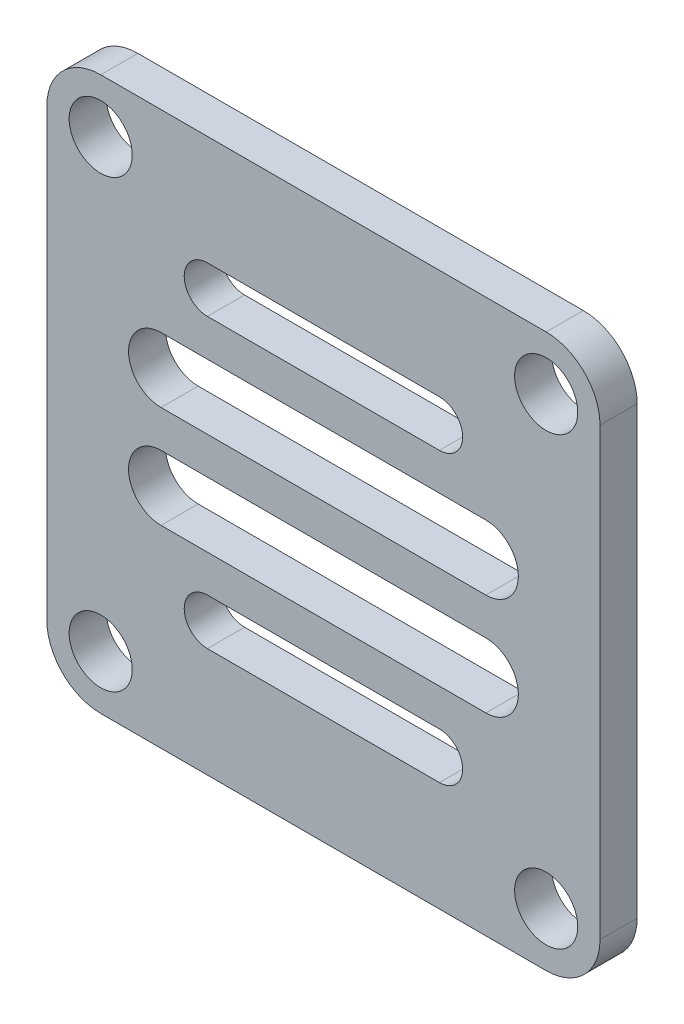
ISO-10303-21;
HEADER;
FILE_DESCRIPTION(('STEP AP214'),'2;1');
FILE_NAME('part.step','',(''),(''),'','','');
FILE_SCHEMA(('AUTOMOTIVE_DESIGN { 1 0 10303 214 1 1 1 1 }'));
ENDSEC;
DATA;
#1=APPLICATION_CONTEXT('core data for automotive mechanical design processes');
#2=APPLICATION_PROTOCOL_DEFINITION('international standard','automotive_design',2000,#1);
#3=PRODUCT_CONTEXT('',#1,'mechanical');
#4=PRODUCT('Part','Part','',(#3));
#5=PRODUCT_RELATED_PRODUCT_CATEGORY('part','',(#4));
#6=PRODUCT_DEFINITION_FORMATION('','',#4);
#7=PRODUCT_DEFINITION_CONTEXT('part definition',#1,'design');
#8=PRODUCT_DEFINITION('design','',#6,#7);
#9=PRODUCT_DEFINITION_SHAPE('','',#8);
#10=(LENGTH_UNIT() NAMED_UNIT(*) SI_UNIT(.MILLI.,.METRE.));
#11=(NAMED_UNIT(*) PLANE_ANGLE_UNIT() SI_UNIT($,.RADIAN.));
#12=(NAMED_UNIT(*) SI_UNIT($,.STERADIAN.) SOLID_ANGLE_UNIT());
#13=UNCERTAINTY_MEASURE_WITH_UNIT(LENGTH_MEASURE(1.E-05),#10,'distance_accuracy_value','');
#14=(GEOMETRIC_REPRESENTATION_CONTEXT(3) GLOBAL_UNCERTAINTY_ASSIGNED_CONTEXT((#13)) GLOBAL_UNIT_ASSIGNED_CONTEXT((#10,
#11,#12)) REPRESENTATION_CONTEXT('',''));
#15=CARTESIAN_POINT('',(0.,0.,0.));
#16=DIRECTION('',(0.,0.,1.));
#17=DIRECTION('',(1.,0.,0.));
#18=AXIS2_PLACEMENT_3D('',#15,#16,#17);
#19=CARTESIAN_POINT('',(-32.3999999999982,0.,-2.));
#20=DIRECTION('',(1.,0.,0.));
#21=DIRECTION('',(0.,0.,-1.));
#22=AXIS2_PLACEMENT_3D('',#19,#20,#21);
#23=PLANE('',#22);
#24=DIRECTION('',(0.,1.,0.));
#25=VECTOR('',#24,1.);
#26=CARTESIAN_POINT('',(-32.3999999999982,0.,0.));
#27=LINE('',#26,#25);
#28=CARTESIAN_POINT('',(-32.3999999999982,-10.5,0.));
#29=VERTEX_POINT('',#28);
#30=CARTESIAN_POINT('',(-32.3999999999982,13.5,0.));
#31=VERTEX_POINT('',#30);
#32=EDGE_CURVE('E246',#29,#31,#27,.T.);
#33=ORIENTED_EDGE('',*,*,#32,.T.);
#34=DIRECTION('',(0.,0.,1.));
#35=VECTOR('',#34,1.);
#36=CARTESIAN_POINT('',(-32.3999999999982,13.5,-2.));
#37=LINE('',#36,#35);
#38=CARTESIAN_POINT('',(-32.3999999999982,13.5,-2.));
#39=VERTEX_POINT('',#38);
#40=EDGE_CURVE('E281',#39,#31,#37,.T.);
#41=ORIENTED_EDGE('',*,*,#40,.F.);
#42=DIRECTION('',(0.,1.,0.));
#43=VECTOR('',#42,1.);
#44=CARTESIAN_POINT('',(-32.3999999999982,0.,-2.));
#45=LINE('',#44,#43);
#46=CARTESIAN_POINT('',(-32.3999999999982,-10.5,-2.));
#47=VERTEX_POINT('',#46);
#48=EDGE_CURVE('E209',#47,#39,#45,.T.);
#49=ORIENTED_EDGE('',*,*,#48,.F.);
#50=DIRECTION('',(0.,0.,1.));
#51=VECTOR('',#50,1.);
#52=CARTESIAN_POINT('',(-32.3999999999982,-10.5,-2.));
#53=LINE('',#52,#51);
#54=EDGE_CURVE('E114',#47,#29,#53,.T.);
#55=ORIENTED_EDGE('',*,*,#54,.T.);
#56=EDGE_LOOP('',(#33,#41,#49,#55));
#57=FACE_BOUND('',#56,.T.);
#58=ADVANCED_FACE('F33',(#57),#23,.F.);
#59=CARTESIAN_POINT('',(-29.4999999999982,13.5,-2.));
#60=DIRECTION('',(0.,0.,1.));
#61=DIRECTION('',(1.,0.,0.));
#62=AXIS2_PLACEMENT_3D('',#59,#60,#61);
#63=CYLINDRICAL_SURFACE('',#62,2.9);
#64=CARTESIAN_POINT('',(-29.4999999999982,13.5,0.));
#65=DIRECTION('',(0.,0.,1.));
#66=DIRECTION('',(1.,0.,0.));
#67=AXIS2_PLACEMENT_3D('',#64,#65,#66);
#68=CIRCLE('',#67,2.9);
#69=CARTESIAN_POINT('',(-29.4999999999982,16.4,0.));
#70=VERTEX_POINT('',#69);
#71=EDGE_CURVE('E267',#70,#31,#68,.T.);
#72=ORIENTED_EDGE('',*,*,#71,.F.);
#73=DIRECTION('',(0.,0.,1.));
#74=VECTOR('',#73,1.);
#75=CARTESIAN_POINT('',(-29.4999999999982,16.4,-2.));
#76=LINE('',#75,#74);
#77=CARTESIAN_POINT('',(-29.4999999999982,16.4,-2.));
#78=VERTEX_POINT('',#77);
#79=EDGE_CURVE('E284',#78,#70,#76,.T.);
#80=ORIENTED_EDGE('',*,*,#79,.F.);
#81=CARTESIAN_POINT('',(-29.4999999999982,13.5,-2.));
#82=DIRECTION('',(0.,0.,1.));
#83=DIRECTION('',(1.,0.,0.));
#84=AXIS2_PLACEMENT_3D('',#81,#82,#83);
#85=CIRCLE('',#84,2.9);
#86=EDGE_CURVE('E231',#78,#39,#85,.T.);
#87=ORIENTED_EDGE('',*,*,#86,.T.);
#88=ORIENTED_EDGE('',*,*,#40,.T.);
#89=EDGE_LOOP('',(#72,#80,#87,#88));
#90=FACE_BOUND('',#89,.T.);
#91=ADVANCED_FACE('F446',(#90),#63,.T.);
#92=CARTESIAN_POINT('',(0.,16.4,-2.));
#93=DIRECTION('',(0.,1.,0.));
#94=DIRECTION('',(0.,0.,1.));
#95=AXIS2_PLACEMENT_3D('',#92,#93,#94);
#96=PLANE('',#95);
#97=DIRECTION('',(-1.,0.,0.));
#98=VECTOR('',#97,1.);
#99=CARTESIAN_POINT('',(0.,16.4,0.));
#100=LINE('',#99,#98);
#101=CARTESIAN_POINT('',(-5.49999999999824,16.4,0.));
#102=VERTEX_POINT('',#101);
#103=EDGE_CURVE('E264',#102,#70,#100,.T.);
#104=ORIENTED_EDGE('',*,*,#103,.F.);
#105=DIRECTION('',(0.,0.,1.));
#106=VECTOR('',#105,1.);
#107=CARTESIAN_POINT('',(-5.49999999999824,16.4,-2.));
#108=LINE('',#107,#106);
#109=CARTESIAN_POINT('',(-5.49999999999824,16.4,-2.));
#110=VERTEX_POINT('',#109);
#111=EDGE_CURVE('E286',#110,#102,#108,.T.);
#112=ORIENTED_EDGE('',*,*,#111,.F.);
#113=DIRECTION('',(-1.,0.,0.));
#114=VECTOR('',#113,1.);
#115=CARTESIAN_POINT('',(0.,16.4,-2.));
#116=LINE('',#115,#114);
#117=EDGE_CURVE('E228',#110,#78,#116,.T.);
#118=ORIENTED_EDGE('',*,*,#117,.T.);
#119=ORIENTED_EDGE('',*,*,#79,.T.);
#120=EDGE_LOOP('',(#104,#112,#118,#119));
#121=FACE_BOUND('',#120,.T.);
#122=ADVANCED_FACE('F448',(#121),#96,.T.);
#123=CARTESIAN_POINT('',(-5.49999999999824,13.5,-2.));
#124=DIRECTION('',(0.,0.,1.));
#125=DIRECTION('',(1.,0.,0.));
#126=AXIS2_PLACEMENT_3D('',#123,#124,#125);
#127=CYLINDRICAL_SURFACE('',#126,2.9);
#128=CARTESIAN_POINT('',(-5.49999999999824,13.5,0.));
#129=DIRECTION('',(0.,0.,1.));
#130=DIRECTION('',(1.,0.,0.));
#131=AXIS2_PLACEMENT_3D('',#128,#129,#130);
#132=CIRCLE('',#131,2.9);
#133=CARTESIAN_POINT('',(-2.59999999999824,13.5,6.17561557447743E-13));
#134=VERTEX_POINT('',#133);
#135=EDGE_CURVE('E261',#134,#102,#132,.T.);
#136=ORIENTED_EDGE('',*,*,#135,.F.);
#137=DIRECTION('',(0.,0.,1.));
#138=VECTOR('',#137,1.);
#139=CARTESIAN_POINT('',(-2.59999999999824,13.5,-1.99999999999938));
#140=LINE('',#139,#138);
#141=CARTESIAN_POINT('',(-2.59999999999824,13.5,-1.99999999999938));
#142=VERTEX_POINT('',#141);
#143=EDGE_CURVE('E288',#142,#134,#140,.T.);
#144=ORIENTED_EDGE('',*,*,#143,.F.);
#145=CARTESIAN_POINT('',(-5.49999999999824,13.5,-2.));
#146=DIRECTION('',(0.,0.,1.));
#147=DIRECTION('',(1.,0.,0.));
#148=AXIS2_PLACEMENT_3D('',#145,#146,#147);
#149=CIRCLE('',#148,2.9);
#150=EDGE_CURVE('E225',#142,#110,#149,.T.);
#151=ORIENTED_EDGE('',*,*,#150,.T.);
#152=ORIENTED_EDGE('',*,*,#111,.T.);
#153=EDGE_LOOP('',(#136,#144,#151,#152));
#154=FACE_BOUND('',#153,.T.);
#155=ADVANCED_FACE('F454',(#154),#127,.T.);
#156=CARTESIAN_POINT('',(-2.59999999999824,0.,-1.99999999999876));
#157=DIRECTION('',(1.,0.,0.));
#158=DIRECTION('',(0.,1.,0.));
#159=AXIS2_PLACEMENT_3D('',#156,#157,#158);
#160=PLANE('',#159);
#161=DIRECTION('',(0.,1.,0.));
#162=VECTOR('',#161,1.);
#163=CARTESIAN_POINT('',(-2.59999999999824,0.,1.23512311489549E-12));
#164=LINE('',#163,#162);
#165=CARTESIAN_POINT('',(-2.59999999999824,-10.5,6.17561557447743E-13));
#166=VERTEX_POINT('',#165);
#167=EDGE_CURVE('E258',#166,#134,#164,.T.);
#168=ORIENTED_EDGE('',*,*,#167,.F.);
#169=DIRECTION('',(0.,0.,1.));
#170=VECTOR('',#169,1.);
#171=CARTESIAN_POINT('',(-2.59999999999824,-10.5,-1.99999999999938));
#172=LINE('',#171,#170);
#173=CARTESIAN_POINT('',(-2.59999999999824,-10.5,-1.99999999999938));
#174=VERTEX_POINT('',#173);
#175=EDGE_CURVE('E290',#174,#166,#172,.T.);
#176=ORIENTED_EDGE('',*,*,#175,.F.);
#177=DIRECTION('',(0.,1.,0.));
#178=VECTOR('',#177,1.);
#179=CARTESIAN_POINT('',(-2.59999999999824,0.,-1.99999999999876));
#180=LINE('',#179,#178);
#181=EDGE_CURVE('E222',#174,#142,#180,.T.);
#182=ORIENTED_EDGE('',*,*,#181,.T.);
#183=ORIENTED_EDGE('',*,*,#143,.T.);
#184=EDGE_LOOP('',(#168,#176,#182,#183));
#185=FACE_BOUND('',#184,.T.);
#186=ADVANCED_FACE('F463',(#185),#160,.T.);
#187=CARTESIAN_POINT('',(-5.49999999999824,-10.5,-2.));
#188=DIRECTION('',(0.,0.,1.));
#189=DIRECTION('',(1.,0.,0.));
#190=AXIS2_PLACEMENT_3D('',#187,#188,#189);
#191=CYLINDRICAL_SURFACE('',#190,2.9);
#192=CARTESIAN_POINT('',(-5.49999999999824,-10.5,0.));
#193=DIRECTION('',(0.,0.,1.));
#194=DIRECTION('',(1.,0.,0.));
#195=AXIS2_PLACEMENT_3D('',#192,#193,#194);
#196=CIRCLE('',#195,2.9);
#197=CARTESIAN_POINT('',(-5.49999999999824,-13.4,0.));
#198=VERTEX_POINT('',#197);
#199=EDGE_CURVE('E255',#198,#166,#196,.T.);
#200=ORIENTED_EDGE('',*,*,#199,.F.);
#201=DIRECTION('',(0.,0.,1.));
#202=VECTOR('',#201,1.);
#203=CARTESIAN_POINT('',(-5.49999999999824,-13.4,-2.));
#204=LINE('',#203,#202);
#205=CARTESIAN_POINT('',(-5.49999999999824,-13.4,-2.));
#206=VERTEX_POINT('',#205);
#207=EDGE_CURVE('E292',#206,#198,#204,.T.);
#208=ORIENTED_EDGE('',*,*,#207,.F.);
#209=CARTESIAN_POINT('',(-5.49999999999824,-10.5,-2.));
#210=DIRECTION('',(0.,0.,1.));
#211=DIRECTION('',(1.,0.,0.));
#212=AXIS2_PLACEMENT_3D('',#209,#210,#211);
#213=CIRCLE('',#212,2.9);
#214=EDGE_CURVE('E219',#206,#174,#213,.T.);
#215=ORIENTED_EDGE('',*,*,#214,.T.);
#216=ORIENTED_EDGE('',*,*,#175,.T.);
#217=EDGE_LOOP('',(#200,#208,#215,#216));
#218=FACE_BOUND('',#217,.T.);
#219=ADVANCED_FACE('F467',(#218),#191,.T.);
#220=CARTESIAN_POINT('',(0.,-13.4,-2.));
#221=DIRECTION('',(0.,1.,0.));
#222=DIRECTION('',(-1.,0.,0.));
#223=AXIS2_PLACEMENT_3D('',#220,#221,#222);
#224=PLANE('',#223);
#225=DIRECTION('',(-1.,0.,0.));
#226=VECTOR('',#225,1.);
#227=CARTESIAN_POINT('',(0.,-13.4,0.));
#228=LINE('',#227,#226);
#229=CARTESIAN_POINT('',(-29.4999999999982,-13.4,0.));
#230=VERTEX_POINT('',#229);
#231=EDGE_CURVE('E252',#198,#230,#228,.T.);
#232=ORIENTED_EDGE('',*,*,#231,.T.);
#233=DIRECTION('',(0.,0.,1.));
#234=VECTOR('',#233,1.);
#235=CARTESIAN_POINT('',(-29.4999999999982,-13.4,-2.));
#236=LINE('',#235,#234);
#237=CARTESIAN_POINT('',(-29.4999999999982,-13.4,-2.));
#238=VERTEX_POINT('',#237);
#239=EDGE_CURVE('E294',#238,#230,#236,.T.);
#240=ORIENTED_EDGE('',*,*,#239,.F.);
#241=DIRECTION('',(-1.,0.,0.));
#242=VECTOR('',#241,1.);
#243=CARTESIAN_POINT('',(0.,-13.4,-2.));
#244=LINE('',#243,#242);
#245=EDGE_CURVE('E216',#206,#238,#244,.T.);
#246=ORIENTED_EDGE('',*,*,#245,.F.);
#247=ORIENTED_EDGE('',*,*,#207,.T.);
#248=EDGE_LOOP('',(#232,#240,#246,#247));
#249=FACE_BOUND('',#248,.T.);
#250=ADVANCED_FACE('F471',(#249),#224,.F.);
#251=CARTESIAN_POINT('',(-5.49999999999824,-10.5,-2.));
#252=DIRECTION('',(0.,0.,1.));
#253=DIRECTION('',(1.,0.,0.));
#254=AXIS2_PLACEMENT_3D('',#251,#252,#253);
#255=CYLINDRICAL_SURFACE('',#254,1.7);
#256=CARTESIAN_POINT('',(-5.49999999999824,-10.5,-2.));
#257=DIRECTION('',(0.,0.,1.));
#258=DIRECTION('',(1.,0.,0.));
#259=AXIS2_PLACEMENT_3D('',#256,#257,#258);
#260=CIRCLE('',#259,1.7);
#261=CARTESIAN_POINT('',(-3.79999999999824,-10.5,-2.));
#262=VERTEX_POINT('',#261);
#263=EDGE_CURVE('E240',#262,#262,#260,.T.);
#264=ORIENTED_EDGE('',*,*,#263,.F.);
#265=EDGE_LOOP('',(#264));
#266=FACE_BOUND('',#265,.T.);
#267=CARTESIAN_POINT('',(-5.49999999999824,-10.5,0.));
#268=DIRECTION('',(0.,0.,1.));
#269=DIRECTION('',(1.,0.,0.));
#270=AXIS2_PLACEMENT_3D('',#267,#268,#269);
#271=CIRCLE('',#270,1.7);
#272=CARTESIAN_POINT('',(-3.79999999999824,-10.5,0.));
#273=VERTEX_POINT('',#272);
#274=EDGE_CURVE('E276',#273,#273,#271,.T.);
#275=ORIENTED_EDGE('',*,*,#274,.T.);
#276=EDGE_LOOP('',(#275));
#277=FACE_BOUND('',#276,.T.);
#278=ADVANCED_FACE('F474',(#266,#277),#255,.F.);
#279=CARTESIAN_POINT('',(-5.49999999999824,13.5,-2.));
#280=DIRECTION('',(0.,0.,1.));
#281=DIRECTION('',(1.,0.,0.));
#282=AXIS2_PLACEMENT_3D('',#279,#280,#281);
#283=CYLINDRICAL_SURFACE('',#282,1.7);
#284=CARTESIAN_POINT('',(-5.49999999999824,13.5,-2.));
#285=DIRECTION('',(0.,0.,1.));
#286=DIRECTION('',(1.,0.,0.));
#287=AXIS2_PLACEMENT_3D('',#284,#285,#286);
#288=CIRCLE('',#287,1.7);
#289=CARTESIAN_POINT('',(-3.79999999999824,13.5,-2.));
#290=VERTEX_POINT('',#289);
#291=EDGE_CURVE('E237',#290,#290,#288,.T.);
#292=ORIENTED_EDGE('',*,*,#291,.F.);
#293=EDGE_LOOP('',(#292));
#294=FACE_BOUND('',#293,.T.);
#295=CARTESIAN_POINT('',(-5.49999999999824,13.5,0.));
#296=DIRECTION('',(0.,0.,1.));
#297=DIRECTION('',(1.,0.,0.));
#298=AXIS2_PLACEMENT_3D('',#295,#296,#297);
#299=CIRCLE('',#298,1.7);
#300=CARTESIAN_POINT('',(-3.79999999999824,13.5,0.));
#301=VERTEX_POINT('',#300);
#302=EDGE_CURVE('E273',#301,#301,#299,.T.);
#303=ORIENTED_EDGE('',*,*,#302,.T.);
#304=EDGE_LOOP('',(#303));
#305=FACE_BOUND('',#304,.T.);
#306=ADVANCED_FACE('F486',(#294,#305),#283,.F.);
#307=CARTESIAN_POINT('',(-29.4999999999982,13.5,-2.));
#308=DIRECTION('',(0.,0.,1.));
#309=DIRECTION('',(1.,0.,0.));
#310=AXIS2_PLACEMENT_3D('',#307,#308,#309);
#311=CYLINDRICAL_SURFACE('',#310,1.7);
#312=CARTESIAN_POINT('',(-29.4999999999982,13.5,-2.));
#313=DIRECTION('',(0.,0.,1.));
#314=DIRECTION('',(1.,0.,0.));
#315=AXIS2_PLACEMENT_3D('',#312,#313,#314);
#316=CIRCLE('',#315,1.7);
#317=CARTESIAN_POINT('',(-27.7999999999982,13.5,-2.));
#318=VERTEX_POINT('',#317);
#319=EDGE_CURVE('E234',#318,#318,#316,.T.);
#320=ORIENTED_EDGE('',*,*,#319,.F.);
#321=EDGE_LOOP('',(#320));
#322=FACE_BOUND('',#321,.T.);
#323=CARTESIAN_POINT('',(-29.4999999999982,13.5,0.));
#324=DIRECTION('',(0.,0.,1.));
#325=DIRECTION('',(1.,0.,0.));
#326=AXIS2_PLACEMENT_3D('',#323,#324,#325);
#327=CIRCLE('',#326,1.7);
#328=CARTESIAN_POINT('',(-27.7999999999982,13.5,0.));
#329=VERTEX_POINT('',#328);
#330=EDGE_CURVE('E270',#329,#329,#327,.T.);
#331=ORIENTED_EDGE('',*,*,#330,.T.);
#332=EDGE_LOOP('',(#331));
#333=FACE_BOUND('',#332,.T.);
#334=ADVANCED_FACE('F458',(#322,#333),#311,.F.);
#335=CARTESIAN_POINT('',(-29.4999999999982,-10.5,-2.));
#336=DIRECTION('',(0.,0.,1.));
#337=DIRECTION('',(1.,0.,0.));
#338=AXIS2_PLACEMENT_3D('',#335,#336,#337);
#339=CYLINDRICAL_SURFACE('',#338,2.9);
#340=CARTESIAN_POINT('',(-29.4999999999982,-10.5,0.));
#341=DIRECTION('',(0.,0.,1.));
#342=DIRECTION('',(1.,0.,0.));
#343=AXIS2_PLACEMENT_3D('',#340,#341,#342);
#344=CIRCLE('',#343,2.9);
#345=EDGE_CURVE('E248',#29,#230,#344,.T.);
#346=ORIENTED_EDGE('',*,*,#345,.F.);
#347=ORIENTED_EDGE('',*,*,#54,.F.);
#348=CARTESIAN_POINT('',(-29.4999999999982,-10.5,-2.));
#349=DIRECTION('',(0.,0.,1.));
#350=DIRECTION('',(1.,0.,0.));
#351=AXIS2_PLACEMENT_3D('',#348,#349,#350);
#352=CIRCLE('',#351,2.9);
#353=EDGE_CURVE('E212',#47,#238,#352,.T.);
#354=ORIENTED_EDGE('',*,*,#353,.T.);
#355=ORIENTED_EDGE('',*,*,#239,.T.);
#356=EDGE_LOOP('',(#346,#347,#354,#355));
#357=FACE_BOUND('',#356,.T.);
#358=ADVANCED_FACE('F476',(#357),#339,.T.);
#359=CARTESIAN_POINT('',(-29.4999999999982,-10.5,-2.));
#360=DIRECTION('',(0.,0.,1.));
#361=DIRECTION('',(1.,0.,0.));
#362=AXIS2_PLACEMENT_3D('',#359,#360,#361);
#363=CYLINDRICAL_SURFACE('',#362,1.7);
#364=CARTESIAN_POINT('',(-29.4999999999982,-10.5,-2.));
#365=DIRECTION('',(0.,0.,1.));
#366=DIRECTION('',(1.,0.,0.));
#367=AXIS2_PLACEMENT_3D('',#364,#365,#366);
#368=CIRCLE('',#367,1.7);
#369=CARTESIAN_POINT('',(-27.7999999999982,-10.5,-2.));
#370=VERTEX_POINT('',#369);
#371=EDGE_CURVE('E243',#370,#370,#368,.T.);
#372=ORIENTED_EDGE('',*,*,#371,.F.);
#373=EDGE_LOOP('',(#372));
#374=FACE_BOUND('',#373,.T.);
#375=CARTESIAN_POINT('',(-29.4999999999982,-10.5,0.));
#376=DIRECTION('',(0.,0.,1.));
#377=DIRECTION('',(1.,0.,0.));
#378=AXIS2_PLACEMENT_3D('',#375,#376,#377);
#379=CIRCLE('',#378,1.7);
#380=CARTESIAN_POINT('',(-27.7999999999982,-10.5,0.));
#381=VERTEX_POINT('',#380);
#382=EDGE_CURVE('E213',#381,#381,#379,.T.);
#383=ORIENTED_EDGE('',*,*,#382,.T.);
#384=EDGE_LOOP('',(#383));
#385=FACE_BOUND('',#384,.T.);
#386=ADVANCED_FACE('F478',(#374,#385),#363,.F.);
#387=CARTESIAN_POINT('',(0.,0.,-2.));
#388=DIRECTION('',(0.,0.,1.));
#389=DIRECTION('',(1.,0.,0.));
#390=AXIS2_PLACEMENT_3D('',#387,#388,#389);
#391=PLANE('',#390);
#392=DIRECTION('',(-1.,0.,0.));
#393=VECTOR('',#392,1.);
#394=CARTESIAN_POINT('',(-23.7499999999982,10.5,-2.));
#395=LINE('',#394,#393);
#396=CARTESIAN_POINT('',(-11.2499999999982,10.5,-2.));
#397=VERTEX_POINT('',#396);
#398=CARTESIAN_POINT('',(-23.7499999999982,10.5,-2.));
#399=VERTEX_POINT('',#398);
#400=EDGE_CURVE('E335',#397,#399,#395,.T.);
#401=ORIENTED_EDGE('',*,*,#400,.T.);
#402=CARTESIAN_POINT('',(-23.7499999999982,9.25000000000003,-2.));
#403=DIRECTION('',(0.,0.,1.));
#404=DIRECTION('',(1.,0.,0.));
#405=AXIS2_PLACEMENT_3D('',#402,#403,#404);
#406=CIRCLE('',#405,1.25);
#407=CARTESIAN_POINT('',(-23.7499999999982,8.00000000000003,-2.));
#408=VERTEX_POINT('',#407);
#409=EDGE_CURVE('E377',#399,#408,#406,.T.);
#410=ORIENTED_EDGE('',*,*,#409,.T.);
#411=DIRECTION('',(1.,0.,0.));
#412=VECTOR('',#411,1.);
#413=CARTESIAN_POINT('',(-23.7499999999982,8.00000000000003,-2.));
#414=LINE('',#413,#412);
#415=CARTESIAN_POINT('',(-11.2499999999982,8.00000000000003,-2.));
#416=VERTEX_POINT('',#415);
#417=EDGE_CURVE('E351',#408,#416,#414,.T.);
#418=ORIENTED_EDGE('',*,*,#417,.T.);
#419=CARTESIAN_POINT('',(-11.2499999999982,9.25000000000003,-2.));
#420=DIRECTION('',(0.,0.,1.));
#421=DIRECTION('',(1.,0.,0.));
#422=AXIS2_PLACEMENT_3D('',#419,#420,#421);
#423=CIRCLE('',#422,1.25);
#424=EDGE_CURVE('E49',#416,#397,#423,.T.);
#425=ORIENTED_EDGE('',*,*,#424,.T.);
#426=EDGE_LOOP('',(#401,#410,#418,#425));
#427=FACE_BOUND('',#426,.T.);
#428=DIRECTION('',(-1.,0.,0.));
#429=VECTOR('',#428,1.);
#430=CARTESIAN_POINT('',(-26.2499999999982,6.00000000000003,-2.));
#431=LINE('',#430,#429);
#432=CARTESIAN_POINT('',(-8.74999999999823,6.00000000000003,-2.));
#433=VERTEX_POINT('',#432);
#434=CARTESIAN_POINT('',(-26.2499999999982,6.00000000000003,-2.));
#435=VERTEX_POINT('',#434);
#436=EDGE_CURVE('E366',#433,#435,#431,.T.);
#437=ORIENTED_EDGE('',*,*,#436,.T.);
#438=CARTESIAN_POINT('',(-26.2499999999982,4.25000000000003,-2.));
#439=DIRECTION('',(0.,0.,1.));
#440=DIRECTION('',(1.,0.,0.));
#441=AXIS2_PLACEMENT_3D('',#438,#439,#440);
#442=CIRCLE('',#441,1.75);
#443=CARTESIAN_POINT('',(-26.2499999999982,2.50000000000003,-2.));
#444=VERTEX_POINT('',#443);
#445=EDGE_CURVE('E185',#435,#444,#442,.T.);
#446=ORIENTED_EDGE('',*,*,#445,.T.);
#447=DIRECTION('',(1.,0.,0.));
#448=VECTOR('',#447,1.);
#449=CARTESIAN_POINT('',(-26.2499999999982,2.50000000000003,-2.));
#450=LINE('',#449,#448);
#451=CARTESIAN_POINT('',(-8.74999999999823,2.50000000000003,-2.));
#452=VERTEX_POINT('',#451);
#453=EDGE_CURVE('E360',#444,#452,#450,.T.);
#454=ORIENTED_EDGE('',*,*,#453,.T.);
#455=CARTESIAN_POINT('',(-8.74999999999823,4.25000000000003,-2.));
#456=DIRECTION('',(0.,0.,1.));
#457=DIRECTION('',(1.,0.,0.));
#458=AXIS2_PLACEMENT_3D('',#455,#456,#457);
#459=CIRCLE('',#458,1.75);
#460=EDGE_CURVE('E363',#452,#433,#459,.T.);
#461=ORIENTED_EDGE('',*,*,#460,.T.);
#462=EDGE_LOOP('',(#437,#446,#454,#461));
#463=FACE_BOUND('',#462,.T.);
#464=DIRECTION('',(-1.,0.,0.));
#465=VECTOR('',#464,1.);
#466=CARTESIAN_POINT('',(-26.2499999999982,0.500000000000032,-2.));
#467=LINE('',#466,#465);
#468=CARTESIAN_POINT('',(-8.74999999999823,0.50000000000003,-2.));
#469=VERTEX_POINT('',#468);
#470=CARTESIAN_POINT('',(-26.2499999999982,0.500000000000032,-2.));
#471=VERTEX_POINT('',#470);
#472=EDGE_CURVE('E159',#469,#471,#467,.T.);
#473=ORIENTED_EDGE('',*,*,#472,.T.);
#474=CARTESIAN_POINT('',(-26.2499999999982,-1.24999999999997,-2.));
#475=DIRECTION('',(0.,0.,1.));
#476=DIRECTION('',(-1.,0.,0.));
#477=AXIS2_PLACEMENT_3D('',#474,#475,#476);
#478=CIRCLE('',#477,1.75);
#479=CARTESIAN_POINT('',(-26.2499999999982,-2.99999999999997,-2.));
#480=VERTEX_POINT('',#479);
#481=EDGE_CURVE('E174',#471,#480,#478,.T.);
#482=ORIENTED_EDGE('',*,*,#481,.T.);
#483=DIRECTION('',(1.,0.,0.));
#484=VECTOR('',#483,1.);
#485=CARTESIAN_POINT('',(-26.2499999999982,-2.99999999999997,-2.));
#486=LINE('',#485,#484);
#487=CARTESIAN_POINT('',(-8.74999999999823,-2.99999999999997,-2.));
#488=VERTEX_POINT('',#487);
#489=EDGE_CURVE('E160',#480,#488,#486,.T.);
#490=ORIENTED_EDGE('',*,*,#489,.T.);
#491=CARTESIAN_POINT('',(-8.74999999999823,-1.24999999999997,-2.));
#492=DIRECTION('',(0.,0.,1.));
#493=DIRECTION('',(-1.,0.,0.));
#494=AXIS2_PLACEMENT_3D('',#491,#492,#493);
#495=CIRCLE('',#494,1.75);
#496=EDGE_CURVE('E147',#488,#469,#495,.T.);
#497=ORIENTED_EDGE('',*,*,#496,.T.);
#498=EDGE_LOOP('',(#473,#482,#490,#497));
#499=FACE_BOUND('',#498,.T.);
#500=DIRECTION('',(-1.,0.,0.));
#501=VECTOR('',#500,1.);
#502=CARTESIAN_POINT('',(-23.7499999999982,-4.99999999999997,-2.));
#503=LINE('',#502,#501);
#504=CARTESIAN_POINT('',(-11.2499999999982,-4.99999999999997,-2.));
#505=VERTEX_POINT('',#504);
#506=CARTESIAN_POINT('',(-23.7499999999982,-4.99999999999997,-2.));
#507=VERTEX_POINT('',#506);
#508=EDGE_CURVE('E196',#505,#507,#503,.T.);
#509=ORIENTED_EDGE('',*,*,#508,.T.);
#510=CARTESIAN_POINT('',(-23.7499999999982,-6.24999999999997,-2.));
#511=DIRECTION('',(0.,0.,1.));
#512=DIRECTION('',(-1.,0.,0.));
#513=AXIS2_PLACEMENT_3D('',#510,#511,#512);
#514=CIRCLE('',#513,1.25);
#515=CARTESIAN_POINT('',(-23.7499999999982,-7.49999999999997,-2.));
#516=VERTEX_POINT('',#515);
#517=EDGE_CURVE('E187',#507,#516,#514,.T.);
#518=ORIENTED_EDGE('',*,*,#517,.T.);
#519=DIRECTION('',(1.,0.,0.));
#520=VECTOR('',#519,1.);
#521=CARTESIAN_POINT('',(-23.7499999999982,-7.49999999999997,-2.));
#522=LINE('',#521,#520);
#523=CARTESIAN_POINT('',(-11.2499999999982,-7.49999999999997,-2.));
#524=VERTEX_POINT('',#523);
#525=EDGE_CURVE('E190',#516,#524,#522,.T.);
#526=ORIENTED_EDGE('',*,*,#525,.T.);
#527=CARTESIAN_POINT('',(-11.2499999999982,-6.24999999999997,-2.));
#528=DIRECTION('',(0.,0.,1.));
#529=DIRECTION('',(-1.,0.,0.));
#530=AXIS2_PLACEMENT_3D('',#527,#528,#529);
#531=CIRCLE('',#530,1.25);
#532=EDGE_CURVE('E193',#524,#505,#531,.T.);
#533=ORIENTED_EDGE('',*,*,#532,.T.);
#534=EDGE_LOOP('',(#509,#518,#526,#533));
#535=FACE_BOUND('',#534,.T.);
#536=ORIENTED_EDGE('',*,*,#48,.T.);
#537=ORIENTED_EDGE('',*,*,#86,.F.);
#538=ORIENTED_EDGE('',*,*,#117,.F.);
#539=ORIENTED_EDGE('',*,*,#150,.F.);
#540=ORIENTED_EDGE('',*,*,#181,.F.);
#541=ORIENTED_EDGE('',*,*,#214,.F.);
#542=ORIENTED_EDGE('',*,*,#245,.T.);
#543=ORIENTED_EDGE('',*,*,#353,.F.);
#544=EDGE_LOOP('',(#536,#537,#538,#539,#540,#541,#542,#543));
#545=FACE_BOUND('',#544,.T.);
#546=ORIENTED_EDGE('',*,*,#319,.T.);
#547=EDGE_LOOP('',(#546));
#548=FACE_BOUND('',#547,.T.);
#549=ORIENTED_EDGE('',*,*,#291,.T.);
#550=EDGE_LOOP('',(#549));
#551=FACE_BOUND('',#550,.T.);
#552=ORIENTED_EDGE('',*,*,#263,.T.);
#553=EDGE_LOOP('',(#552));
#554=FACE_BOUND('',#553,.T.);
#555=ORIENTED_EDGE('',*,*,#371,.T.);
#556=EDGE_LOOP('',(#555));
#557=FACE_BOUND('',#556,.T.);
#558=ADVANCED_FACE('F171',(#427,#463,#499,#535,#545,#548,#551,#554,#557),#391,.F.);
#559=CARTESIAN_POINT('',(0.,0.,0.));
#560=DIRECTION('',(0.,0.,1.));
#561=DIRECTION('',(1.,0.,0.));
#562=AXIS2_PLACEMENT_3D('',#559,#560,#561);
#563=PLANE('',#562);
#564=CARTESIAN_POINT('',(-23.7499999999982,9.25000000000003,0.));
#565=DIRECTION('',(0.,0.,1.));
#566=DIRECTION('',(1.,0.,0.));
#567=AXIS2_PLACEMENT_3D('',#564,#565,#566);
#568=CIRCLE('',#567,1.25);
#569=CARTESIAN_POINT('',(-23.7499999999982,10.5,0.));
#570=VERTEX_POINT('',#569);
#571=CARTESIAN_POINT('',(-23.7499999999982,8.00000000000003,0.));
#572=VERTEX_POINT('',#571);
#573=EDGE_CURVE('E11',#570,#572,#568,.T.);
#574=ORIENTED_EDGE('',*,*,#573,.F.);
#575=DIRECTION('',(-1.,0.,0.));
#576=VECTOR('',#575,1.);
#577=CARTESIAN_POINT('',(-23.7499999999982,10.5,0.));
#578=LINE('',#577,#576);
#579=CARTESIAN_POINT('',(-11.2499999999982,10.5,0.));
#580=VERTEX_POINT('',#579);
#581=EDGE_CURVE('E41',#580,#570,#578,.T.);
#582=ORIENTED_EDGE('',*,*,#581,.F.);
#583=CARTESIAN_POINT('',(-11.2499999999982,9.25000000000003,0.));
#584=DIRECTION('',(0.,0.,1.));
#585=DIRECTION('',(1.,0.,0.));
#586=AXIS2_PLACEMENT_3D('',#583,#584,#585);
#587=CIRCLE('',#586,1.25);
#588=CARTESIAN_POINT('',(-11.2499999999982,8.00000000000003,0.));
#589=VERTEX_POINT('',#588);
#590=EDGE_CURVE('E324',#589,#580,#587,.T.);
#591=ORIENTED_EDGE('',*,*,#590,.F.);
#592=DIRECTION('',(1.,0.,0.));
#593=VECTOR('',#592,1.);
#594=CARTESIAN_POINT('',(-23.7499999999982,8.00000000000003,0.));
#595=LINE('',#594,#593);
#596=EDGE_CURVE('E322',#572,#589,#595,.T.);
#597=ORIENTED_EDGE('',*,*,#596,.F.);
#598=EDGE_LOOP('',(#574,#582,#591,#597));
#599=FACE_BOUND('',#598,.T.);
#600=CARTESIAN_POINT('',(-26.2499999999982,4.25000000000003,0.));
#601=DIRECTION('',(0.,0.,1.));
#602=DIRECTION('',(1.,0.,0.));
#603=AXIS2_PLACEMENT_3D('',#600,#601,#602);
#604=CIRCLE('',#603,1.75);
#605=CARTESIAN_POINT('',(-26.2499999999982,6.00000000000003,0.));
#606=VERTEX_POINT('',#605);
#607=CARTESIAN_POINT('',(-26.2499999999982,2.50000000000003,0.));
#608=VERTEX_POINT('',#607);
#609=EDGE_CURVE('E319',#606,#608,#604,.T.);
#610=ORIENTED_EDGE('',*,*,#609,.F.);
#611=DIRECTION('',(-1.,0.,0.));
#612=VECTOR('',#611,1.);
#613=CARTESIAN_POINT('',(-26.2499999999982,6.00000000000003,0.));
#614=LINE('',#613,#612);
#615=CARTESIAN_POINT('',(-8.74999999999823,6.00000000000003,0.));
#616=VERTEX_POINT('',#615);
#617=EDGE_CURVE('E317',#616,#606,#614,.T.);
#618=ORIENTED_EDGE('',*,*,#617,.F.);
#619=CARTESIAN_POINT('',(-8.74999999999823,4.25000000000003,0.));
#620=DIRECTION('',(0.,0.,1.));
#621=DIRECTION('',(1.,0.,0.));
#622=AXIS2_PLACEMENT_3D('',#619,#620,#621);
#623=CIRCLE('',#622,1.75);
#624=CARTESIAN_POINT('',(-8.74999999999823,2.50000000000003,0.));
#625=VERTEX_POINT('',#624);
#626=EDGE_CURVE('E315',#625,#616,#623,.T.);
#627=ORIENTED_EDGE('',*,*,#626,.F.);
#628=DIRECTION('',(1.,0.,0.));
#629=VECTOR('',#628,1.);
#630=CARTESIAN_POINT('',(-26.2499999999982,2.50000000000003,0.));
#631=LINE('',#630,#629);
#632=EDGE_CURVE('E313',#608,#625,#631,.T.);
#633=ORIENTED_EDGE('',*,*,#632,.F.);
#634=EDGE_LOOP('',(#610,#618,#627,#633));
#635=FACE_BOUND('',#634,.T.);
#636=CARTESIAN_POINT('',(-26.2499999999982,-1.24999999999997,0.));
#637=DIRECTION('',(0.,0.,1.));
#638=DIRECTION('',(1.,0.,0.));
#639=AXIS2_PLACEMENT_3D('',#636,#637,#638);
#640=CIRCLE('',#639,1.75);
#641=CARTESIAN_POINT('',(-26.2499999999982,0.500000000000032,0.));
#642=VERTEX_POINT('',#641);
#643=CARTESIAN_POINT('',(-26.2499999999982,-2.99999999999997,0.));
#644=VERTEX_POINT('',#643);
#645=EDGE_CURVE('E310',#642,#644,#640,.T.);
#646=ORIENTED_EDGE('',*,*,#645,.F.);
#647=DIRECTION('',(-1.,0.,0.));
#648=VECTOR('',#647,1.);
#649=CARTESIAN_POINT('',(-26.2499999999982,0.500000000000032,0.));
#650=LINE('',#649,#648);
#651=CARTESIAN_POINT('',(-8.74999999999823,0.50000000000003,0.));
#652=VERTEX_POINT('',#651);
#653=EDGE_CURVE('E308',#652,#642,#650,.T.);
#654=ORIENTED_EDGE('',*,*,#653,.F.);
#655=CARTESIAN_POINT('',(-8.74999999999823,-1.24999999999997,0.));
#656=DIRECTION('',(0.,0.,1.));
#657=DIRECTION('',(1.,0.,0.));
#658=AXIS2_PLACEMENT_3D('',#655,#656,#657);
#659=CIRCLE('',#658,1.75);
#660=CARTESIAN_POINT('',(-8.74999999999823,-2.99999999999997,0.));
#661=VERTEX_POINT('',#660);
#662=EDGE_CURVE('E306',#661,#652,#659,.T.);
#663=ORIENTED_EDGE('',*,*,#662,.F.);
#664=DIRECTION('',(1.,0.,0.));
#665=VECTOR('',#664,1.);
#666=CARTESIAN_POINT('',(-26.2499999999982,-2.99999999999997,0.));
#667=LINE('',#666,#665);
#668=EDGE_CURVE('E168',#644,#661,#667,.T.);
#669=ORIENTED_EDGE('',*,*,#668,.F.);
#670=EDGE_LOOP('',(#646,#654,#663,#669));
#671=FACE_BOUND('',#670,.T.);
#672=CARTESIAN_POINT('',(-23.7499999999982,-6.24999999999997,0.));
#673=DIRECTION('',(0.,0.,1.));
#674=DIRECTION('',(1.,0.,0.));
#675=AXIS2_PLACEMENT_3D('',#672,#673,#674);
#676=CIRCLE('',#675,1.25);
#677=CARTESIAN_POINT('',(-23.7499999999982,-4.99999999999997,0.));
#678=VERTEX_POINT('',#677);
#679=CARTESIAN_POINT('',(-23.7499999999982,-7.49999999999997,0.));
#680=VERTEX_POINT('',#679);
#681=EDGE_CURVE('E302',#678,#680,#676,.T.);
#682=ORIENTED_EDGE('',*,*,#681,.F.);
#683=DIRECTION('',(-1.,0.,0.));
#684=VECTOR('',#683,1.);
#685=CARTESIAN_POINT('',(-23.7499999999982,-4.99999999999997,0.));
#686=LINE('',#685,#684);
#687=CARTESIAN_POINT('',(-11.2499999999982,-4.99999999999997,0.));
#688=VERTEX_POINT('',#687);
#689=EDGE_CURVE('E300',#688,#678,#686,.T.);
#690=ORIENTED_EDGE('',*,*,#689,.F.);
#691=CARTESIAN_POINT('',(-11.2499999999982,-6.24999999999997,0.));
#692=DIRECTION('',(0.,0.,1.));
#693=DIRECTION('',(1.,0.,0.));
#694=AXIS2_PLACEMENT_3D('',#691,#692,#693);
#695=CIRCLE('',#694,1.25);
#696=CARTESIAN_POINT('',(-11.2499999999982,-7.49999999999997,0.));
#697=VERTEX_POINT('',#696);
#698=EDGE_CURVE('E298',#697,#688,#695,.T.);
#699=ORIENTED_EDGE('',*,*,#698,.F.);
#700=DIRECTION('',(1.,0.,0.));
#701=VECTOR('',#700,1.);
#702=CARTESIAN_POINT('',(-23.7499999999982,-7.49999999999997,0.));
#703=LINE('',#702,#701);
#704=EDGE_CURVE('E283',#680,#697,#703,.T.);
#705=ORIENTED_EDGE('',*,*,#704,.F.);
#706=EDGE_LOOP('',(#682,#690,#699,#705));
#707=FACE_BOUND('',#706,.T.);
#708=ORIENTED_EDGE('',*,*,#32,.F.);
#709=ORIENTED_EDGE('',*,*,#345,.T.);
#710=ORIENTED_EDGE('',*,*,#231,.F.);
#711=ORIENTED_EDGE('',*,*,#199,.T.);
#712=ORIENTED_EDGE('',*,*,#167,.T.);
#713=ORIENTED_EDGE('',*,*,#135,.T.);
#714=ORIENTED_EDGE('',*,*,#103,.T.);
#715=ORIENTED_EDGE('',*,*,#71,.T.);
#716=EDGE_LOOP('',(#708,#709,#710,#711,#712,#713,#714,#715));
#717=FACE_BOUND('',#716,.T.);
#718=ORIENTED_EDGE('',*,*,#330,.F.);
#719=EDGE_LOOP('',(#718));
#720=FACE_BOUND('',#719,.T.);
#721=ORIENTED_EDGE('',*,*,#302,.F.);
#722=EDGE_LOOP('',(#721));
#723=FACE_BOUND('',#722,.T.);
#724=ORIENTED_EDGE('',*,*,#274,.F.);
#725=EDGE_LOOP('',(#724));
#726=FACE_BOUND('',#725,.T.);
#727=ORIENTED_EDGE('',*,*,#382,.F.);
#728=EDGE_LOOP('',(#727));
#729=FACE_BOUND('',#728,.T.);
#730=ADVANCED_FACE('F338',(#599,#635,#671,#707,#717,#720,#723,#726,#729),#563,.T.);
#731=CARTESIAN_POINT('',(-23.7499999999982,-6.24999999999997,-2.));
#732=DIRECTION('',(0.,0.,1.));
#733=DIRECTION('',(1.,0.,0.));
#734=AXIS2_PLACEMENT_3D('',#731,#732,#733);
#735=CYLINDRICAL_SURFACE('',#734,1.25);
#736=ORIENTED_EDGE('',*,*,#681,.T.);
#737=DIRECTION('',(0.,0.,1.));
#738=VECTOR('',#737,1.);
#739=CARTESIAN_POINT('',(-23.7499999999982,-7.49999999999997,-2.));
#740=LINE('',#739,#738);
#741=EDGE_CURVE('E199',#516,#680,#740,.T.);
#742=ORIENTED_EDGE('',*,*,#741,.F.);
#743=ORIENTED_EDGE('',*,*,#517,.F.);
#744=DIRECTION('',(0.,0.,1.));
#745=VECTOR('',#744,1.);
#746=CARTESIAN_POINT('',(-23.7499999999982,-4.99999999999997,-2.));
#747=LINE('',#746,#745);
#748=EDGE_CURVE('E176',#507,#678,#747,.T.);
#749=ORIENTED_EDGE('',*,*,#748,.T.);
#750=EDGE_LOOP('',(#736,#742,#743,#749));
#751=FACE_BOUND('',#750,.T.);
#752=ADVANCED_FACE('F502',(#751),#735,.F.);
#753=CARTESIAN_POINT('',(-23.7499999999982,-4.99999999999997,-2.));
#754=DIRECTION('',(0.,1.,0.));
#755=DIRECTION('',(-1.,0.,0.));
#756=AXIS2_PLACEMENT_3D('',#753,#754,#755);
#757=PLANE('',#756);
#758=ORIENTED_EDGE('',*,*,#689,.T.);
#759=ORIENTED_EDGE('',*,*,#748,.F.);
#760=ORIENTED_EDGE('',*,*,#508,.F.);
#761=DIRECTION('',(0.,0.,1.));
#762=VECTOR('',#761,1.);
#763=CARTESIAN_POINT('',(-11.2499999999982,-4.99999999999997,-2.));
#764=LINE('',#763,#762);
#765=EDGE_CURVE('E200',#505,#688,#764,.T.);
#766=ORIENTED_EDGE('',*,*,#765,.T.);
#767=EDGE_LOOP('',(#758,#759,#760,#766));
#768=FACE_BOUND('',#767,.T.);
#769=ADVANCED_FACE('F527',(#768),#757,.F.);
#770=CARTESIAN_POINT('',(-11.2499999999982,-6.24999999999997,-2.));
#771=DIRECTION('',(0.,0.,1.));
#772=DIRECTION('',(1.,0.,0.));
#773=AXIS2_PLACEMENT_3D('',#770,#771,#772);
#774=CYLINDRICAL_SURFACE('',#773,1.25);
#775=ORIENTED_EDGE('',*,*,#698,.T.);
#776=ORIENTED_EDGE('',*,*,#765,.F.);
#777=ORIENTED_EDGE('',*,*,#532,.F.);
#778=DIRECTION('',(0.,0.,1.));
#779=VECTOR('',#778,1.);
#780=CARTESIAN_POINT('',(-11.2499999999982,-7.49999999999997,-2.));
#781=LINE('',#780,#779);
#782=EDGE_CURVE('E203',#524,#697,#781,.T.);
#783=ORIENTED_EDGE('',*,*,#782,.T.);
#784=EDGE_LOOP('',(#775,#776,#777,#783));
#785=FACE_BOUND('',#784,.T.);
#786=ADVANCED_FACE('F533',(#785),#774,.F.);
#787=CARTESIAN_POINT('',(-23.7499999999982,-7.49999999999997,-2.));
#788=DIRECTION('',(0.,-1.,0.));
#789=DIRECTION('',(1.,0.,0.));
#790=AXIS2_PLACEMENT_3D('',#787,#788,#789);
#791=PLANE('',#790);
#792=ORIENTED_EDGE('',*,*,#704,.T.);
#793=ORIENTED_EDGE('',*,*,#782,.F.);
#794=ORIENTED_EDGE('',*,*,#525,.F.);
#795=ORIENTED_EDGE('',*,*,#741,.T.);
#796=EDGE_LOOP('',(#792,#793,#794,#795));
#797=FACE_BOUND('',#796,.T.);
#798=ADVANCED_FACE('F529',(#797),#791,.F.);
#799=CARTESIAN_POINT('',(-26.2499999999982,-1.24999999999997,-2.));
#800=DIRECTION('',(0.,0.,1.));
#801=DIRECTION('',(1.,0.,0.));
#802=AXIS2_PLACEMENT_3D('',#799,#800,#801);
#803=CYLINDRICAL_SURFACE('',#802,1.75);
#804=ORIENTED_EDGE('',*,*,#645,.T.);
#805=DIRECTION('',(0.,0.,1.));
#806=VECTOR('',#805,1.);
#807=CARTESIAN_POINT('',(-26.2499999999982,-2.99999999999997,-2.));
#808=LINE('',#807,#806);
#809=EDGE_CURVE('E169',#480,#644,#808,.T.);
#810=ORIENTED_EDGE('',*,*,#809,.F.);
#811=ORIENTED_EDGE('',*,*,#481,.F.);
#812=DIRECTION('',(0.,0.,1.));
#813=VECTOR('',#812,1.);
#814=CARTESIAN_POINT('',(-26.2499999999982,0.500000000000032,-2.));
#815=LINE('',#814,#813);
#816=EDGE_CURVE('E182',#471,#642,#815,.T.);
#817=ORIENTED_EDGE('',*,*,#816,.T.);
#818=EDGE_LOOP('',(#804,#810,#811,#817));
#819=FACE_BOUND('',#818,.T.);
#820=ADVANCED_FACE('F532',(#819),#803,.F.);
#821=CARTESIAN_POINT('',(-26.2499999999982,0.500000000000032,-2.));
#822=DIRECTION('',(0.,1.,0.));
#823=DIRECTION('',(-1.,0.,0.));
#824=AXIS2_PLACEMENT_3D('',#821,#822,#823);
#825=PLANE('',#824);
#826=ORIENTED_EDGE('',*,*,#653,.T.);
#827=ORIENTED_EDGE('',*,*,#816,.F.);
#828=ORIENTED_EDGE('',*,*,#472,.F.);
#829=DIRECTION('',(0.,0.,1.));
#830=VECTOR('',#829,1.);
#831=CARTESIAN_POINT('',(-8.74999999999823,0.50000000000003,-2.));
#832=LINE('',#831,#830);
#833=EDGE_CURVE('E154',#469,#652,#832,.T.);
#834=ORIENTED_EDGE('',*,*,#833,.T.);
#835=EDGE_LOOP('',(#826,#827,#828,#834));
#836=FACE_BOUND('',#835,.T.);
#837=ADVANCED_FACE('F543',(#836),#825,.F.);
#838=CARTESIAN_POINT('',(-8.74999999999823,-1.24999999999997,-2.));
#839=DIRECTION('',(0.,0.,1.));
#840=DIRECTION('',(1.,0.,0.));
#841=AXIS2_PLACEMENT_3D('',#838,#839,#840);
#842=CYLINDRICAL_SURFACE('',#841,1.75);
#843=ORIENTED_EDGE('',*,*,#662,.T.);
#844=ORIENTED_EDGE('',*,*,#833,.F.);
#845=ORIENTED_EDGE('',*,*,#496,.F.);
#846=DIRECTION('',(0.,0.,1.));
#847=VECTOR('',#846,1.);
#848=CARTESIAN_POINT('',(-8.74999999999823,-2.99999999999997,-2.));
#849=LINE('',#848,#847);
#850=EDGE_CURVE('E150',#488,#661,#849,.T.);
#851=ORIENTED_EDGE('',*,*,#850,.T.);
#852=EDGE_LOOP('',(#843,#844,#845,#851));
#853=FACE_BOUND('',#852,.T.);
#854=ADVANCED_FACE('F149',(#853),#842,.F.);
#855=CARTESIAN_POINT('',(-26.2499999999982,-2.99999999999997,-2.));
#856=DIRECTION('',(0.,-1.,0.));
#857=DIRECTION('',(1.,0.,0.));
#858=AXIS2_PLACEMENT_3D('',#855,#856,#857);
#859=PLANE('',#858);
#860=ORIENTED_EDGE('',*,*,#668,.T.);
#861=ORIENTED_EDGE('',*,*,#850,.F.);
#862=ORIENTED_EDGE('',*,*,#489,.F.);
#863=ORIENTED_EDGE('',*,*,#809,.T.);
#864=EDGE_LOOP('',(#860,#861,#862,#863));
#865=FACE_BOUND('',#864,.T.);
#866=ADVANCED_FACE('F164',(#865),#859,.F.);
#867=CARTESIAN_POINT('',(-26.2499999999982,4.25000000000003,-2.));
#868=DIRECTION('',(0.,0.,1.));
#869=DIRECTION('',(1.,0.,0.));
#870=AXIS2_PLACEMENT_3D('',#867,#868,#869);
#871=CYLINDRICAL_SURFACE('',#870,1.75);
#872=ORIENTED_EDGE('',*,*,#609,.T.);
#873=DIRECTION('',(0.,0.,1.));
#874=VECTOR('',#873,1.);
#875=CARTESIAN_POINT('',(-26.2499999999982,2.50000000000003,-2.));
#876=LINE('',#875,#874);
#877=EDGE_CURVE('E369',#444,#608,#876,.T.);
#878=ORIENTED_EDGE('',*,*,#877,.F.);
#879=ORIENTED_EDGE('',*,*,#445,.F.);
#880=DIRECTION('',(0.,0.,1.));
#881=VECTOR('',#880,1.);
#882=CARTESIAN_POINT('',(-26.2499999999982,6.00000000000003,-2.));
#883=LINE('',#882,#881);
#884=EDGE_CURVE('E373',#435,#606,#883,.T.);
#885=ORIENTED_EDGE('',*,*,#884,.T.);
#886=EDGE_LOOP('',(#872,#878,#879,#885));
#887=FACE_BOUND('',#886,.T.);
#888=ADVANCED_FACE('F397',(#887),#871,.F.);
#889=CARTESIAN_POINT('',(-26.2499999999982,6.00000000000003,-2.));
#890=DIRECTION('',(0.,1.,0.));
#891=DIRECTION('',(-1.,0.,0.));
#892=AXIS2_PLACEMENT_3D('',#889,#890,#891);
#893=PLANE('',#892);
#894=ORIENTED_EDGE('',*,*,#617,.T.);
#895=ORIENTED_EDGE('',*,*,#884,.F.);
#896=ORIENTED_EDGE('',*,*,#436,.F.);
#897=DIRECTION('',(0.,0.,1.));
#898=VECTOR('',#897,1.);
#899=CARTESIAN_POINT('',(-8.74999999999823,6.00000000000003,-2.));
#900=LINE('',#899,#898);
#901=EDGE_CURVE('E370',#433,#616,#900,.T.);
#902=ORIENTED_EDGE('',*,*,#901,.T.);
#903=EDGE_LOOP('',(#894,#895,#896,#902));
#904=FACE_BOUND('',#903,.T.);
#905=ADVANCED_FACE('F392',(#904),#893,.F.);
#906=CARTESIAN_POINT('',(-8.74999999999823,4.25000000000003,-2.));
#907=DIRECTION('',(0.,0.,1.));
#908=DIRECTION('',(1.,0.,0.));
#909=AXIS2_PLACEMENT_3D('',#906,#907,#908);
#910=CYLINDRICAL_SURFACE('',#909,1.75);
#911=ORIENTED_EDGE('',*,*,#626,.T.);
#912=ORIENTED_EDGE('',*,*,#901,.F.);
#913=ORIENTED_EDGE('',*,*,#460,.F.);
#914=DIRECTION('',(0.,0.,1.));
#915=VECTOR('',#914,1.);
#916=CARTESIAN_POINT('',(-8.74999999999823,2.50000000000003,-2.));
#917=LINE('',#916,#915);
#918=EDGE_CURVE('E374',#452,#625,#917,.T.);
#919=ORIENTED_EDGE('',*,*,#918,.T.);
#920=EDGE_LOOP('',(#911,#912,#913,#919));
#921=FACE_BOUND('',#920,.T.);
#922=ADVANCED_FACE('F382',(#921),#910,.F.);
#923=CARTESIAN_POINT('',(-26.2499999999982,2.50000000000003,-2.));
#924=DIRECTION('',(0.,-1.,0.));
#925=DIRECTION('',(1.,0.,0.));
#926=AXIS2_PLACEMENT_3D('',#923,#924,#925);
#927=PLANE('',#926);
#928=ORIENTED_EDGE('',*,*,#632,.T.);
#929=ORIENTED_EDGE('',*,*,#918,.F.);
#930=ORIENTED_EDGE('',*,*,#453,.F.);
#931=ORIENTED_EDGE('',*,*,#877,.T.);
#932=EDGE_LOOP('',(#928,#929,#930,#931));
#933=FACE_BOUND('',#932,.T.);
#934=ADVANCED_FACE('F554',(#933),#927,.F.);
#935=CARTESIAN_POINT('',(-23.7499999999982,9.25000000000003,-2.));
#936=DIRECTION('',(0.,0.,1.));
#937=DIRECTION('',(1.,0.,0.));
#938=AXIS2_PLACEMENT_3D('',#935,#936,#937);
#939=CYLINDRICAL_SURFACE('',#938,1.25);
#940=ORIENTED_EDGE('',*,*,#573,.T.);
#941=DIRECTION('',(0.,0.,1.));
#942=VECTOR('',#941,1.);
#943=CARTESIAN_POINT('',(-23.7499999999982,8.00000000000003,-2.));
#944=LINE('',#943,#942);
#945=EDGE_CURVE('E346',#408,#572,#944,.T.);
#946=ORIENTED_EDGE('',*,*,#945,.F.);
#947=ORIENTED_EDGE('',*,*,#409,.F.);
#948=DIRECTION('',(0.,0.,1.));
#949=VECTOR('',#948,1.);
#950=CARTESIAN_POINT('',(-23.7499999999982,10.5,-2.));
#951=LINE('',#950,#949);
#952=EDGE_CURVE('E249',#399,#570,#951,.T.);
#953=ORIENTED_EDGE('',*,*,#952,.T.);
#954=EDGE_LOOP('',(#940,#946,#947,#953));
#955=FACE_BOUND('',#954,.T.);
#956=ADVANCED_FACE('F342',(#955),#939,.F.);
#957=CARTESIAN_POINT('',(-23.7499999999982,10.5,-2.));
#958=DIRECTION('',(0.,1.,0.));
#959=DIRECTION('',(-1.,0.,0.));
#960=AXIS2_PLACEMENT_3D('',#957,#958,#959);
#961=PLANE('',#960);
#962=ORIENTED_EDGE('',*,*,#581,.T.);
#963=ORIENTED_EDGE('',*,*,#952,.F.);
#964=ORIENTED_EDGE('',*,*,#400,.F.);
#965=DIRECTION('',(0.,0.,1.));
#966=VECTOR('',#965,1.);
#967=CARTESIAN_POINT('',(-11.2499999999982,10.5,-2.));
#968=LINE('',#967,#966);
#969=EDGE_CURVE('E328',#397,#580,#968,.T.);
#970=ORIENTED_EDGE('',*,*,#969,.T.);
#971=EDGE_LOOP('',(#962,#963,#964,#970));
#972=FACE_BOUND('',#971,.T.);
#973=ADVANCED_FACE('F333',(#972),#961,.F.);
#974=CARTESIAN_POINT('',(-11.2499999999982,9.25000000000003,-2.));
#975=DIRECTION('',(0.,0.,1.));
#976=DIRECTION('',(1.,0.,0.));
#977=AXIS2_PLACEMENT_3D('',#974,#975,#976);
#978=CYLINDRICAL_SURFACE('',#977,1.25);
#979=ORIENTED_EDGE('',*,*,#590,.T.);
#980=ORIENTED_EDGE('',*,*,#969,.F.);
#981=ORIENTED_EDGE('',*,*,#424,.F.);
#982=DIRECTION('',(0.,0.,1.));
#983=VECTOR('',#982,1.);
#984=CARTESIAN_POINT('',(-11.2499999999982,8.00000000000003,-2.));
#985=LINE('',#984,#983);
#986=EDGE_CURVE('E330',#416,#589,#985,.T.);
#987=ORIENTED_EDGE('',*,*,#986,.T.);
#988=EDGE_LOOP('',(#979,#980,#981,#987));
#989=FACE_BOUND('',#988,.T.);
#990=ADVANCED_FACE('F326',(#989),#978,.F.);
#991=CARTESIAN_POINT('',(-23.7499999999982,8.00000000000003,-2.));
#992=DIRECTION('',(0.,-1.,0.));
#993=DIRECTION('',(1.,0.,0.));
#994=AXIS2_PLACEMENT_3D('',#991,#992,#993);
#995=PLANE('',#994);
#996=ORIENTED_EDGE('',*,*,#596,.T.);
#997=ORIENTED_EDGE('',*,*,#986,.F.);
#998=ORIENTED_EDGE('',*,*,#417,.F.);
#999=ORIENTED_EDGE('',*,*,#945,.T.);
#1000=EDGE_LOOP('',(#996,#997,#998,#999));
#1001=FACE_BOUND('',#1000,.T.);
#1002=ADVANCED_FACE('F349',(#1001),#995,.F.);
#1003=CLOSED_SHELL('',(#58,#91,#122,#155,#186,#219,#250,#278,#306,#334,#358,#386,#558,#730,#752,
#769,#786,#798,#820,#837,#854,#866,#888,#905,#922,#934,#956,#973,#990,#1002));
#1004=MANIFOLD_SOLID_BREP('B2',#1003);
#1005=ADVANCED_BREP_SHAPE_REPRESENTATION('',(#18,#1004),#14);
#1006=SHAPE_DEFINITION_REPRESENTATION(#9,#1005);
ENDSEC;
END-ISO-10303-21;
